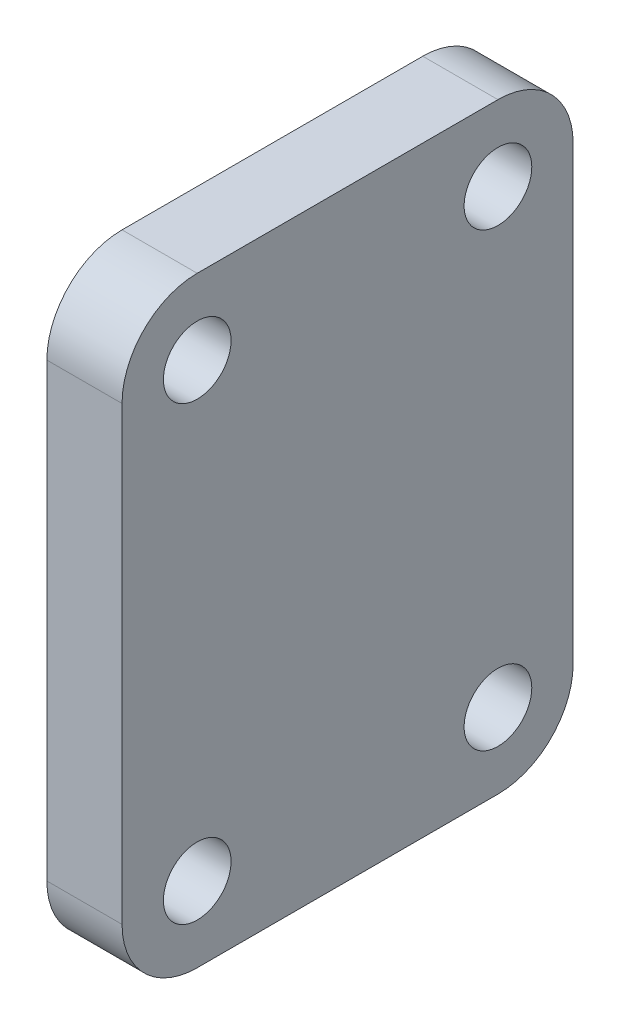
ISO-10303-21;
HEADER;
FILE_DESCRIPTION(('STEP AP214'),'2;1');
FILE_NAME('part.step','',(''),(''),'','','');
FILE_SCHEMA(('AUTOMOTIVE_DESIGN { 1 0 10303 214 1 1 1 1 }'));
ENDSEC;
DATA;
#1=APPLICATION_CONTEXT('core data for automotive mechanical design processes');
#2=APPLICATION_PROTOCOL_DEFINITION('international standard','automotive_design',2000,#1);
#3=PRODUCT_CONTEXT('',#1,'mechanical');
#4=PRODUCT('Part','Part','',(#3));
#5=PRODUCT_RELATED_PRODUCT_CATEGORY('part','',(#4));
#6=PRODUCT_DEFINITION_FORMATION('','',#4);
#7=PRODUCT_DEFINITION_CONTEXT('part definition',#1,'design');
#8=PRODUCT_DEFINITION('design','',#6,#7);
#9=PRODUCT_DEFINITION_SHAPE('','',#8);
#10=(LENGTH_UNIT() NAMED_UNIT(*) SI_UNIT(.MILLI.,.METRE.));
#11=(NAMED_UNIT(*) PLANE_ANGLE_UNIT() SI_UNIT($,.RADIAN.));
#12=(NAMED_UNIT(*) SI_UNIT($,.STERADIAN.) SOLID_ANGLE_UNIT());
#13=UNCERTAINTY_MEASURE_WITH_UNIT(LENGTH_MEASURE(1.E-05),#10,'distance_accuracy_value','');
#14=(GEOMETRIC_REPRESENTATION_CONTEXT(3) GLOBAL_UNCERTAINTY_ASSIGNED_CONTEXT((#13)) GLOBAL_UNIT_ASSIGNED_CONTEXT((#10,
#11,#12)) REPRESENTATION_CONTEXT('',''));
#15=CARTESIAN_POINT('',(0.,0.,0.));
#16=DIRECTION('',(0.,0.,1.));
#17=DIRECTION('',(1.,0.,0.));
#18=AXIS2_PLACEMENT_3D('',#15,#16,#17);
#19=CARTESIAN_POINT('',(5.,0.,0.));
#20=DIRECTION('',(0.,0.,-1.));
#21=DIRECTION('',(-1.,0.,0.));
#22=AXIS2_PLACEMENT_3D('',#19,#20,#21);
#23=PLANE('',#22);
#24=DIRECTION('',(0.,-1.,0.));
#25=VECTOR('',#24,1.);
#26=CARTESIAN_POINT('',(0.,0.,0.));
#27=LINE('',#26,#25);
#28=CARTESIAN_POINT('',(0.,35.,0.));
#29=VERTEX_POINT('',#28);
#30=CARTESIAN_POINT('',(0.,5.,0.));
#31=VERTEX_POINT('',#30);
#32=EDGE_CURVE('E142',#29,#31,#27,.T.);
#33=ORIENTED_EDGE('',*,*,#32,.T.);
#34=DIRECTION('',(-1.,0.,0.));
#35=VECTOR('',#34,1.);
#36=CARTESIAN_POINT('',(5.,5.,0.));
#37=LINE('',#36,#35);
#38=CARTESIAN_POINT('',(5.,5.,0.));
#39=VERTEX_POINT('',#38);
#40=EDGE_CURVE('E164',#31,#39,#37,.F.);
#41=ORIENTED_EDGE('',*,*,#40,.T.);
#42=DIRECTION('',(0.,-1.,0.));
#43=VECTOR('',#42,1.);
#44=CARTESIAN_POINT('',(5.,0.,0.));
#45=LINE('',#44,#43);
#46=CARTESIAN_POINT('',(5.,35.,0.));
#47=VERTEX_POINT('',#46);
#48=EDGE_CURVE('E140',#47,#39,#45,.T.);
#49=ORIENTED_EDGE('',*,*,#48,.F.);
#50=DIRECTION('',(-1.,0.,0.));
#51=VECTOR('',#50,1.);
#52=CARTESIAN_POINT('',(5.,35.,0.));
#53=LINE('',#52,#51);
#54=EDGE_CURVE('E161',#47,#29,#53,.T.);
#55=ORIENTED_EDGE('',*,*,#54,.T.);
#56=EDGE_LOOP('',(#33,#41,#49,#55));
#57=FACE_BOUND('',#56,.T.);
#58=ADVANCED_FACE('F45',(#57),#23,.F.);
#59=CARTESIAN_POINT('',(5.,0.,0.));
#60=DIRECTION('',(0.,1.,0.));
#61=DIRECTION('',(0.,0.,1.));
#62=AXIS2_PLACEMENT_3D('',#59,#60,#61);
#63=PLANE('',#62);
#64=DIRECTION('',(0.,0.,-1.));
#65=VECTOR('',#64,1.);
#66=CARTESIAN_POINT('',(0.,0.,0.));
#67=LINE('',#66,#65);
#68=CARTESIAN_POINT('',(0.,0.,-5.));
#69=VERTEX_POINT('',#68);
#70=CARTESIAN_POINT('',(0.,0.,-25.));
#71=VERTEX_POINT('',#70);
#72=EDGE_CURVE('E138',#69,#71,#67,.T.);
#73=ORIENTED_EDGE('',*,*,#72,.T.);
#74=DIRECTION('',(-1.,0.,0.));
#75=VECTOR('',#74,1.);
#76=CARTESIAN_POINT('',(5.,0.,-25.));
#77=LINE('',#76,#75);
#78=CARTESIAN_POINT('',(5.,0.,-25.));
#79=VERTEX_POINT('',#78);
#80=EDGE_CURVE('E116',#71,#79,#77,.F.);
#81=ORIENTED_EDGE('',*,*,#80,.T.);
#82=DIRECTION('',(0.,0.,-1.));
#83=VECTOR('',#82,1.);
#84=CARTESIAN_POINT('',(5.,0.,0.));
#85=LINE('',#84,#83);
#86=CARTESIAN_POINT('',(5.,0.,-5.));
#87=VERTEX_POINT('',#86);
#88=EDGE_CURVE('E178',#87,#79,#85,.T.);
#89=ORIENTED_EDGE('',*,*,#88,.F.);
#90=DIRECTION('',(-1.,0.,0.));
#91=VECTOR('',#90,1.);
#92=CARTESIAN_POINT('',(5.,0.,-5.));
#93=LINE('',#92,#91);
#94=EDGE_CURVE('E121',#87,#69,#93,.T.);
#95=ORIENTED_EDGE('',*,*,#94,.T.);
#96=EDGE_LOOP('',(#73,#81,#89,#95));
#97=FACE_BOUND('',#96,.T.);
#98=ADVANCED_FACE('F183',(#97),#63,.F.);
#99=CARTESIAN_POINT('',(5.,0.,-30.));
#100=DIRECTION('',(0.,0.,1.));
#101=DIRECTION('',(1.,0.,0.));
#102=AXIS2_PLACEMENT_3D('',#99,#100,#101);
#103=PLANE('',#102);
#104=DIRECTION('',(0.,1.,0.));
#105=VECTOR('',#104,1.);
#106=CARTESIAN_POINT('',(5.,0.,-30.));
#107=LINE('',#106,#105);
#108=CARTESIAN_POINT('',(5.,5.,-30.));
#109=VERTEX_POINT('',#108);
#110=CARTESIAN_POINT('',(5.,35.,-30.));
#111=VERTEX_POINT('',#110);
#112=EDGE_CURVE('E130',#109,#111,#107,.T.);
#113=ORIENTED_EDGE('',*,*,#112,.F.);
#114=DIRECTION('',(-1.,0.,0.));
#115=VECTOR('',#114,1.);
#116=CARTESIAN_POINT('',(5.,5.,-30.));
#117=LINE('',#116,#115);
#118=CARTESIAN_POINT('',(0.,5.,-30.));
#119=VERTEX_POINT('',#118);
#120=EDGE_CURVE('E115',#109,#119,#117,.T.);
#121=ORIENTED_EDGE('',*,*,#120,.T.);
#122=DIRECTION('',(0.,1.,0.));
#123=VECTOR('',#122,1.);
#124=CARTESIAN_POINT('',(0.,0.,-30.));
#125=LINE('',#124,#123);
#126=CARTESIAN_POINT('',(0.,35.,-30.));
#127=VERTEX_POINT('',#126);
#128=EDGE_CURVE('E128',#119,#127,#125,.T.);
#129=ORIENTED_EDGE('',*,*,#128,.T.);
#130=DIRECTION('',(-1.,0.,0.));
#131=VECTOR('',#130,1.);
#132=CARTESIAN_POINT('',(5.,35.,-30.));
#133=LINE('',#132,#131);
#134=EDGE_CURVE('E132',#127,#111,#133,.F.);
#135=ORIENTED_EDGE('',*,*,#134,.T.);
#136=EDGE_LOOP('',(#113,#121,#129,#135));
#137=FACE_BOUND('',#136,.T.);
#138=ADVANCED_FACE('F127',(#137),#103,.F.);
#139=CARTESIAN_POINT('',(5.,40.,0.));
#140=DIRECTION('',(0.,-1.,0.));
#141=DIRECTION('',(0.,0.,-1.));
#142=AXIS2_PLACEMENT_3D('',#139,#140,#141);
#143=PLANE('',#142);
#144=DIRECTION('',(0.,0.,1.));
#145=VECTOR('',#144,1.);
#146=CARTESIAN_POINT('',(5.,40.,0.));
#147=LINE('',#146,#145);
#148=CARTESIAN_POINT('',(5.,40.,-25.));
#149=VERTEX_POINT('',#148);
#150=CARTESIAN_POINT('',(5.,40.,-5.));
#151=VERTEX_POINT('',#150);
#152=EDGE_CURVE('E146',#149,#151,#147,.T.);
#153=ORIENTED_EDGE('',*,*,#152,.F.);
#154=DIRECTION('',(-1.,0.,0.));
#155=VECTOR('',#154,1.);
#156=CARTESIAN_POINT('',(5.,40.,-25.));
#157=LINE('',#156,#155);
#158=CARTESIAN_POINT('',(0.,40.,-25.));
#159=VERTEX_POINT('',#158);
#160=EDGE_CURVE('E11',#149,#159,#157,.T.);
#161=ORIENTED_EDGE('',*,*,#160,.T.);
#162=DIRECTION('',(0.,0.,1.));
#163=VECTOR('',#162,1.);
#164=CARTESIAN_POINT('',(0.,40.,0.));
#165=LINE('',#164,#163);
#166=CARTESIAN_POINT('',(0.,40.,-5.));
#167=VERTEX_POINT('',#166);
#168=EDGE_CURVE('E137',#159,#167,#165,.T.);
#169=ORIENTED_EDGE('',*,*,#168,.T.);
#170=DIRECTION('',(-1.,0.,0.));
#171=VECTOR('',#170,1.);
#172=CARTESIAN_POINT('',(5.,40.,-5.));
#173=LINE('',#172,#171);
#174=EDGE_CURVE('E53',#167,#151,#173,.F.);
#175=ORIENTED_EDGE('',*,*,#174,.T.);
#176=EDGE_LOOP('',(#153,#161,#169,#175));
#177=FACE_BOUND('',#176,.T.);
#178=ADVANCED_FACE('F217',(#177),#143,.F.);
#179=CARTESIAN_POINT('',(5.,0.,0.));
#180=DIRECTION('',(-1.,0.,0.));
#181=DIRECTION('',(0.,0.,1.));
#182=AXIS2_PLACEMENT_3D('',#179,#180,#181);
#183=PLANE('',#182);
#184=CARTESIAN_POINT('',(5.,35.,-25.));
#185=DIRECTION('',(1.,0.,0.));
#186=DIRECTION('',(0.,0.,-1.));
#187=AXIS2_PLACEMENT_3D('',#184,#185,#186);
#188=CIRCLE('',#187,2.25);
#189=CARTESIAN_POINT('',(5.,35.,-27.25));
#190=VERTEX_POINT('',#189);
#191=EDGE_CURVE('E209',#190,#190,#188,.T.);
#192=ORIENTED_EDGE('',*,*,#191,.F.);
#193=EDGE_LOOP('',(#192));
#194=FACE_BOUND('',#193,.T.);
#195=CARTESIAN_POINT('',(5.,5.,-5.));
#196=DIRECTION('',(1.,0.,0.));
#197=DIRECTION('',(0.,0.,-1.));
#198=AXIS2_PLACEMENT_3D('',#195,#196,#197);
#199=CIRCLE('',#198,2.25);
#200=CARTESIAN_POINT('',(5.,5.,-7.25));
#201=VERTEX_POINT('',#200);
#202=EDGE_CURVE('E203',#201,#201,#199,.T.);
#203=ORIENTED_EDGE('',*,*,#202,.F.);
#204=EDGE_LOOP('',(#203));
#205=FACE_BOUND('',#204,.T.);
#206=CARTESIAN_POINT('',(5.,5.,-25.));
#207=DIRECTION('',(1.,0.,0.));
#208=DIRECTION('',(0.,0.,-1.));
#209=AXIS2_PLACEMENT_3D('',#206,#207,#208);
#210=CIRCLE('',#209,2.25);
#211=CARTESIAN_POINT('',(5.,5.,-27.25));
#212=VERTEX_POINT('',#211);
#213=EDGE_CURVE('E197',#212,#212,#210,.T.);
#214=ORIENTED_EDGE('',*,*,#213,.F.);
#215=EDGE_LOOP('',(#214));
#216=FACE_BOUND('',#215,.T.);
#217=CARTESIAN_POINT('',(5.,35.,-5.));
#218=DIRECTION('',(1.,0.,0.));
#219=DIRECTION('',(0.,0.,-1.));
#220=AXIS2_PLACEMENT_3D('',#217,#218,#219);
#221=CIRCLE('',#220,2.25);
#222=CARTESIAN_POINT('',(5.,35.,-7.25));
#223=VERTEX_POINT('',#222);
#224=EDGE_CURVE('E186',#223,#223,#221,.T.);
#225=ORIENTED_EDGE('',*,*,#224,.F.);
#226=EDGE_LOOP('',(#225));
#227=FACE_BOUND('',#226,.T.);
#228=ORIENTED_EDGE('',*,*,#88,.T.);
#229=CARTESIAN_POINT('',(5.,5.,-25.));
#230=DIRECTION('',(-1.,0.,0.));
#231=DIRECTION('',(0.,0.,1.));
#232=AXIS2_PLACEMENT_3D('',#229,#230,#231);
#233=CIRCLE('',#232,5.);
#234=EDGE_CURVE('E159',#79,#109,#233,.F.);
#235=ORIENTED_EDGE('',*,*,#234,.T.);
#236=ORIENTED_EDGE('',*,*,#112,.T.);
#237=CARTESIAN_POINT('',(5.,35.,-25.));
#238=DIRECTION('',(-1.,0.,0.));
#239=DIRECTION('',(0.,0.,1.));
#240=AXIS2_PLACEMENT_3D('',#237,#238,#239);
#241=CIRCLE('',#240,5.);
#242=EDGE_CURVE('E66',#111,#149,#241,.F.);
#243=ORIENTED_EDGE('',*,*,#242,.T.);
#244=ORIENTED_EDGE('',*,*,#152,.T.);
#245=CARTESIAN_POINT('',(5.,35.,-5.));
#246=DIRECTION('',(-1.,0.,0.));
#247=DIRECTION('',(0.,0.,1.));
#248=AXIS2_PLACEMENT_3D('',#245,#246,#247);
#249=CIRCLE('',#248,5.);
#250=EDGE_CURVE('E154',#151,#47,#249,.F.);
#251=ORIENTED_EDGE('',*,*,#250,.T.);
#252=ORIENTED_EDGE('',*,*,#48,.T.);
#253=CARTESIAN_POINT('',(5.,5.,-5.));
#254=DIRECTION('',(-1.,0.,0.));
#255=DIRECTION('',(0.,0.,1.));
#256=AXIS2_PLACEMENT_3D('',#253,#254,#255);
#257=CIRCLE('',#256,5.);
#258=EDGE_CURVE('E157',#39,#87,#257,.F.);
#259=ORIENTED_EDGE('',*,*,#258,.T.);
#260=EDGE_LOOP('',(#228,#235,#236,#243,#244,#251,#252,#259));
#261=FACE_BOUND('',#260,.T.);
#262=ADVANCED_FACE('F175',(#194,#205,#216,#227,#261),#183,.F.);
#263=CARTESIAN_POINT('',(0.,0.,0.));
#264=DIRECTION('',(-1.,0.,0.));
#265=DIRECTION('',(0.,0.,1.));
#266=AXIS2_PLACEMENT_3D('',#263,#264,#265);
#267=PLANE('',#266);
#268=CARTESIAN_POINT('',(0.,35.,-25.));
#269=DIRECTION('',(1.,0.,0.));
#270=DIRECTION('',(0.,0.,-1.));
#271=AXIS2_PLACEMENT_3D('',#268,#269,#270);
#272=CIRCLE('',#271,2.25);
#273=CARTESIAN_POINT('',(0.,35.,-27.25));
#274=VERTEX_POINT('',#273);
#275=EDGE_CURVE('E206',#274,#274,#272,.T.);
#276=ORIENTED_EDGE('',*,*,#275,.T.);
#277=EDGE_LOOP('',(#276));
#278=FACE_BOUND('',#277,.T.);
#279=CARTESIAN_POINT('',(0.,5.,-5.));
#280=DIRECTION('',(1.,0.,0.));
#281=DIRECTION('',(0.,0.,-1.));
#282=AXIS2_PLACEMENT_3D('',#279,#280,#281);
#283=CIRCLE('',#282,2.25);
#284=CARTESIAN_POINT('',(0.,5.,-7.25));
#285=VERTEX_POINT('',#284);
#286=EDGE_CURVE('E200',#285,#285,#283,.T.);
#287=ORIENTED_EDGE('',*,*,#286,.T.);
#288=EDGE_LOOP('',(#287));
#289=FACE_BOUND('',#288,.T.);
#290=CARTESIAN_POINT('',(0.,5.,-25.));
#291=DIRECTION('',(1.,0.,0.));
#292=DIRECTION('',(0.,0.,-1.));
#293=AXIS2_PLACEMENT_3D('',#290,#291,#292);
#294=CIRCLE('',#293,2.25);
#295=CARTESIAN_POINT('',(0.,5.,-27.25));
#296=VERTEX_POINT('',#295);
#297=EDGE_CURVE('E194',#296,#296,#294,.T.);
#298=ORIENTED_EDGE('',*,*,#297,.T.);
#299=EDGE_LOOP('',(#298));
#300=FACE_BOUND('',#299,.T.);
#301=CARTESIAN_POINT('',(0.,35.,-5.));
#302=DIRECTION('',(1.,0.,0.));
#303=DIRECTION('',(0.,0.,-1.));
#304=AXIS2_PLACEMENT_3D('',#301,#302,#303);
#305=CIRCLE('',#304,2.25);
#306=CARTESIAN_POINT('',(0.,35.,-7.25));
#307=VERTEX_POINT('',#306);
#308=EDGE_CURVE('E184',#307,#307,#305,.T.);
#309=ORIENTED_EDGE('',*,*,#308,.T.);
#310=EDGE_LOOP('',(#309));
#311=FACE_BOUND('',#310,.T.);
#312=ORIENTED_EDGE('',*,*,#128,.F.);
#313=CARTESIAN_POINT('',(0.,5.,-25.));
#314=DIRECTION('',(-1.,0.,0.));
#315=DIRECTION('',(0.,0.,1.));
#316=AXIS2_PLACEMENT_3D('',#313,#314,#315);
#317=CIRCLE('',#316,5.);
#318=EDGE_CURVE('E111',#119,#71,#317,.T.);
#319=ORIENTED_EDGE('',*,*,#318,.T.);
#320=ORIENTED_EDGE('',*,*,#72,.F.);
#321=CARTESIAN_POINT('',(0.,5.,-5.));
#322=DIRECTION('',(-1.,0.,0.));
#323=DIRECTION('',(0.,0.,1.));
#324=AXIS2_PLACEMENT_3D('',#321,#322,#323);
#325=CIRCLE('',#324,5.);
#326=EDGE_CURVE('E122',#69,#31,#325,.T.);
#327=ORIENTED_EDGE('',*,*,#326,.T.);
#328=ORIENTED_EDGE('',*,*,#32,.F.);
#329=CARTESIAN_POINT('',(0.,35.,-5.));
#330=DIRECTION('',(-1.,0.,0.));
#331=DIRECTION('',(0.,0.,1.));
#332=AXIS2_PLACEMENT_3D('',#329,#330,#331);
#333=CIRCLE('',#332,5.);
#334=EDGE_CURVE('E131',#29,#167,#333,.T.);
#335=ORIENTED_EDGE('',*,*,#334,.T.);
#336=ORIENTED_EDGE('',*,*,#168,.F.);
#337=CARTESIAN_POINT('',(0.,35.,-25.));
#338=DIRECTION('',(-1.,0.,0.));
#339=DIRECTION('',(0.,0.,1.));
#340=AXIS2_PLACEMENT_3D('',#337,#338,#339);
#341=CIRCLE('',#340,5.);
#342=EDGE_CURVE('E136',#159,#127,#341,.T.);
#343=ORIENTED_EDGE('',*,*,#342,.T.);
#344=EDGE_LOOP('',(#312,#319,#320,#327,#328,#335,#336,#343));
#345=FACE_BOUND('',#344,.T.);
#346=ADVANCED_FACE('F134',(#278,#289,#300,#311,#345),#267,.T.);
#347=CARTESIAN_POINT('',(5.,35.,-5.));
#348=DIRECTION('',(1.,0.,0.));
#349=DIRECTION('',(0.,0.,-1.));
#350=AXIS2_PLACEMENT_3D('',#347,#348,#349);
#351=CYLINDRICAL_SURFACE('',#350,2.25);
#352=ORIENTED_EDGE('',*,*,#308,.F.);
#353=EDGE_LOOP('',(#352));
#354=FACE_BOUND('',#353,.T.);
#355=ORIENTED_EDGE('',*,*,#224,.T.);
#356=EDGE_LOOP('',(#355));
#357=FACE_BOUND('',#356,.T.);
#358=ADVANCED_FACE('F225',(#354,#357),#351,.F.);
#359=CARTESIAN_POINT('',(5.,5.,-25.));
#360=DIRECTION('',(1.,0.,0.));
#361=DIRECTION('',(0.,0.,-1.));
#362=AXIS2_PLACEMENT_3D('',#359,#360,#361);
#363=CYLINDRICAL_SURFACE('',#362,2.25);
#364=ORIENTED_EDGE('',*,*,#297,.F.);
#365=EDGE_LOOP('',(#364));
#366=FACE_BOUND('',#365,.T.);
#367=ORIENTED_EDGE('',*,*,#213,.T.);
#368=EDGE_LOOP('',(#367));
#369=FACE_BOUND('',#368,.T.);
#370=ADVANCED_FACE('F227',(#366,#369),#363,.F.);
#371=CARTESIAN_POINT('',(5.,5.,-5.));
#372=DIRECTION('',(1.,0.,0.));
#373=DIRECTION('',(0.,0.,-1.));
#374=AXIS2_PLACEMENT_3D('',#371,#372,#373);
#375=CYLINDRICAL_SURFACE('',#374,2.25);
#376=ORIENTED_EDGE('',*,*,#286,.F.);
#377=EDGE_LOOP('',(#376));
#378=FACE_BOUND('',#377,.T.);
#379=ORIENTED_EDGE('',*,*,#202,.T.);
#380=EDGE_LOOP('',(#379));
#381=FACE_BOUND('',#380,.T.);
#382=ADVANCED_FACE('F233',(#378,#381),#375,.F.);
#383=CARTESIAN_POINT('',(5.,35.,-25.));
#384=DIRECTION('',(1.,0.,0.));
#385=DIRECTION('',(0.,0.,-1.));
#386=AXIS2_PLACEMENT_3D('',#383,#384,#385);
#387=CYLINDRICAL_SURFACE('',#386,2.25);
#388=ORIENTED_EDGE('',*,*,#275,.F.);
#389=EDGE_LOOP('',(#388));
#390=FACE_BOUND('',#389,.T.);
#391=ORIENTED_EDGE('',*,*,#191,.T.);
#392=EDGE_LOOP('',(#391));
#393=FACE_BOUND('',#392,.T.);
#394=ADVANCED_FACE('F213',(#390,#393),#387,.F.);
#395=CARTESIAN_POINT('',(5.,5.,-25.));
#396=DIRECTION('',(-1.,0.,0.));
#397=DIRECTION('',(0.,0.,1.));
#398=AXIS2_PLACEMENT_3D('',#395,#396,#397);
#399=CYLINDRICAL_SURFACE('',#398,5.);
#400=ORIENTED_EDGE('',*,*,#234,.F.);
#401=ORIENTED_EDGE('',*,*,#80,.F.);
#402=ORIENTED_EDGE('',*,*,#318,.F.);
#403=ORIENTED_EDGE('',*,*,#120,.F.);
#404=EDGE_LOOP('',(#400,#401,#402,#403));
#405=FACE_BOUND('',#404,.T.);
#406=ADVANCED_FACE('F114',(#405),#399,.T.);
#407=CARTESIAN_POINT('',(5.,5.,-5.));
#408=DIRECTION('',(-1.,0.,0.));
#409=DIRECTION('',(0.,0.,1.));
#410=AXIS2_PLACEMENT_3D('',#407,#408,#409);
#411=CYLINDRICAL_SURFACE('',#410,5.);
#412=ORIENTED_EDGE('',*,*,#258,.F.);
#413=ORIENTED_EDGE('',*,*,#40,.F.);
#414=ORIENTED_EDGE('',*,*,#326,.F.);
#415=ORIENTED_EDGE('',*,*,#94,.F.);
#416=EDGE_LOOP('',(#412,#413,#414,#415));
#417=FACE_BOUND('',#416,.T.);
#418=ADVANCED_FACE('F181',(#417),#411,.T.);
#419=CARTESIAN_POINT('',(5.,35.,-25.));
#420=DIRECTION('',(-1.,0.,0.));
#421=DIRECTION('',(0.,0.,1.));
#422=AXIS2_PLACEMENT_3D('',#419,#420,#421);
#423=CYLINDRICAL_SURFACE('',#422,5.);
#424=ORIENTED_EDGE('',*,*,#242,.F.);
#425=ORIENTED_EDGE('',*,*,#134,.F.);
#426=ORIENTED_EDGE('',*,*,#342,.F.);
#427=ORIENTED_EDGE('',*,*,#160,.F.);
#428=EDGE_LOOP('',(#424,#425,#426,#427));
#429=FACE_BOUND('',#428,.T.);
#430=ADVANCED_FACE('F252',(#429),#423,.T.);
#431=CARTESIAN_POINT('',(5.,35.,-5.));
#432=DIRECTION('',(-1.,0.,0.));
#433=DIRECTION('',(0.,0.,1.));
#434=AXIS2_PLACEMENT_3D('',#431,#432,#433);
#435=CYLINDRICAL_SURFACE('',#434,5.);
#436=ORIENTED_EDGE('',*,*,#250,.F.);
#437=ORIENTED_EDGE('',*,*,#174,.F.);
#438=ORIENTED_EDGE('',*,*,#334,.F.);
#439=ORIENTED_EDGE('',*,*,#54,.F.);
#440=EDGE_LOOP('',(#436,#437,#438,#439));
#441=FACE_BOUND('',#440,.T.);
#442=ADVANCED_FACE('F47',(#441),#435,.T.);
#443=CLOSED_SHELL('',(#58,#98,#138,#178,#262,#346,#358,#370,#382,#394,#406,#418,#430,#442));
#444=MANIFOLD_SOLID_BREP('B2',#443);
#445=ADVANCED_BREP_SHAPE_REPRESENTATION('',(#18,#444),#14);
#446=SHAPE_DEFINITION_REPRESENTATION(#9,#445);
ENDSEC;
END-ISO-10303-21;
